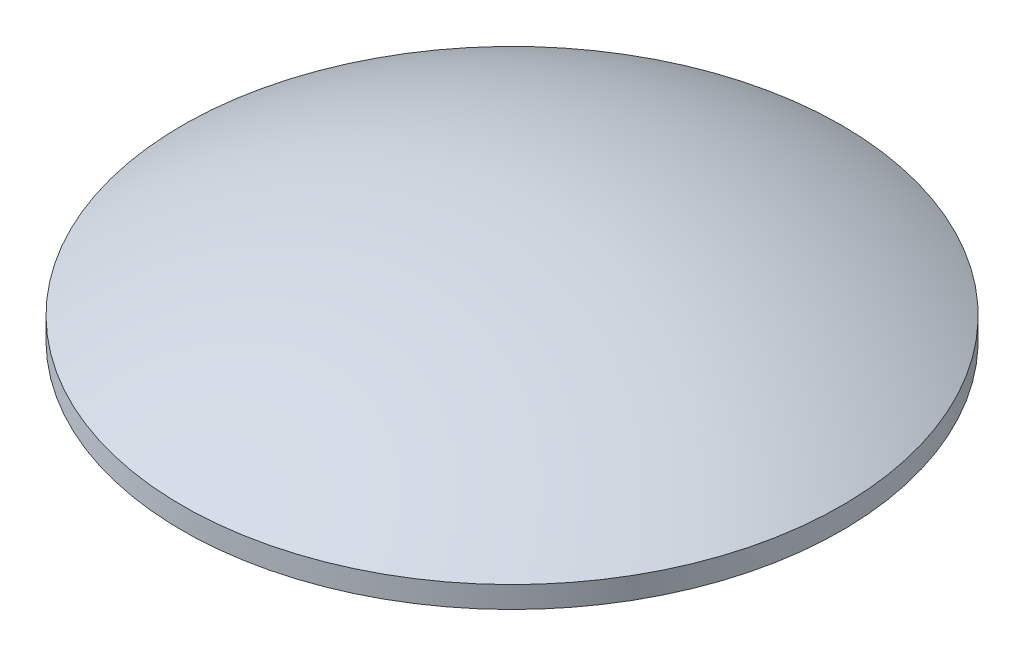
ISO-10303-21;
HEADER;
FILE_DESCRIPTION(('STEP AP214'),'2;1');
FILE_NAME('part.step','',(''),(''),'','','');
FILE_SCHEMA(('AUTOMOTIVE_DESIGN { 1 0 10303 214 1 1 1 1 }'));
ENDSEC;
DATA;
#1=APPLICATION_CONTEXT('core data for automotive mechanical design processes');
#2=APPLICATION_PROTOCOL_DEFINITION('international standard','automotive_design',2000,#1);
#3=PRODUCT_CONTEXT('',#1,'mechanical');
#4=PRODUCT('Part','Part','',(#3));
#5=PRODUCT_RELATED_PRODUCT_CATEGORY('part','',(#4));
#6=PRODUCT_DEFINITION_FORMATION('','',#4);
#7=PRODUCT_DEFINITION_CONTEXT('part definition',#1,'design');
#8=PRODUCT_DEFINITION('design','',#6,#7);
#9=PRODUCT_DEFINITION_SHAPE('','',#8);
#10=(LENGTH_UNIT() NAMED_UNIT(*) SI_UNIT(.MILLI.,.METRE.));
#11=(NAMED_UNIT(*) PLANE_ANGLE_UNIT() SI_UNIT($,.RADIAN.));
#12=(NAMED_UNIT(*) SI_UNIT($,.STERADIAN.) SOLID_ANGLE_UNIT());
#13=UNCERTAINTY_MEASURE_WITH_UNIT(LENGTH_MEASURE(1.E-05),#10,'distance_accuracy_value','');
#14=(GEOMETRIC_REPRESENTATION_CONTEXT(3) GLOBAL_UNCERTAINTY_ASSIGNED_CONTEXT((#13)) GLOBAL_UNIT_ASSIGNED_CONTEXT((#10,
#11,#12)) REPRESENTATION_CONTEXT('',''));
#15=CARTESIAN_POINT('',(0.,0.,0.));
#16=DIRECTION('',(0.,0.,1.));
#17=DIRECTION('',(1.,0.,0.));
#18=AXIS2_PLACEMENT_3D('',#15,#16,#17);
#19=CARTESIAN_POINT('',(-5.11590769747272E-13,6350.54204623156,-843.244434569781));
#20=DIRECTION('',(0.,0.,-1.));
#21=DIRECTION('',(0.,-1.,0.));
#22=AXIS2_PLACEMENT_3D('',#19,#20,#21);
#23=SPHERICAL_SURFACE('',#22,527.431408470526);
#24=CARTESIAN_POINT('',(0.,5826.76738987522,-843.244434569781));
#25=DIRECTION('',(0.,-1.,0.));
#26=DIRECTION('',(0.,0.,-1.));
#27=AXIS2_PLACEMENT_3D('',#24,#25,#26);
#28=CIRCLE('',#27,62.);
#29=CARTESIAN_POINT('',(0.,5826.76738987522,-905.244434569781));
#30=VERTEX_POINT('',#29);
#31=EDGE_CURVE('E20',#30,#30,#28,.F.);
#32=ORIENTED_EDGE('',*,*,#31,.F.);
#33=EDGE_LOOP('',(#32));
#34=FACE_BOUND('',#33,.T.);
#35=ADVANCED_FACE('F15',(#34),#23,.T.);
#36=CARTESIAN_POINT('',(0.,5830.83050854135,-843.244434569781));
#37=DIRECTION('',(0.,-1.,0.));
#38=DIRECTION('',(0.,0.,-1.));
#39=AXIS2_PLACEMENT_3D('',#36,#37,#38);
#40=CYLINDRICAL_SURFACE('',#39,62.);
#41=CARTESIAN_POINT('',(0.,5830.83050854135,-843.244434569781));
#42=DIRECTION('',(0.,-1.,0.));
#43=DIRECTION('',(0.,0.,-1.));
#44=AXIS2_PLACEMENT_3D('',#41,#42,#43);
#45=CIRCLE('',#44,62.);
#46=CARTESIAN_POINT('',(0.,5830.83050854135,-905.244434569781));
#47=VERTEX_POINT('',#46);
#48=EDGE_CURVE('E10',#47,#47,#45,.F.);
#49=ORIENTED_EDGE('',*,*,#48,.F.);
#50=EDGE_LOOP('',(#49));
#51=FACE_BOUND('',#50,.T.);
#52=ORIENTED_EDGE('',*,*,#31,.T.);
#53=EDGE_LOOP('',(#52));
#54=FACE_BOUND('',#53,.T.);
#55=ADVANCED_FACE('F32',(#51,#54),#40,.T.);
#56=CARTESIAN_POINT('',(0.,5728.2445530465,-843.244434569781));
#57=DIRECTION('',(0.,0.,-1.));
#58=DIRECTION('',(0.,1.,0.));
#59=AXIS2_PLACEMENT_3D('',#56,#57,#58);
#60=SPHERICAL_SURFACE('',#59,119.866084714525);
#61=ORIENTED_EDGE('',*,*,#48,.T.);
#62=EDGE_LOOP('',(#61));
#63=FACE_BOUND('',#62,.T.);
#64=ADVANCED_FACE('F17',(#63),#60,.T.);
#65=CLOSED_SHELL('',(#35,#55,#64));
#66=MANIFOLD_SOLID_BREP('B1',#65);
#67=ADVANCED_BREP_SHAPE_REPRESENTATION('',(#18,#66),#14);
#68=SHAPE_DEFINITION_REPRESENTATION(#9,#67);
ENDSEC;
END-ISO-10303-21;
